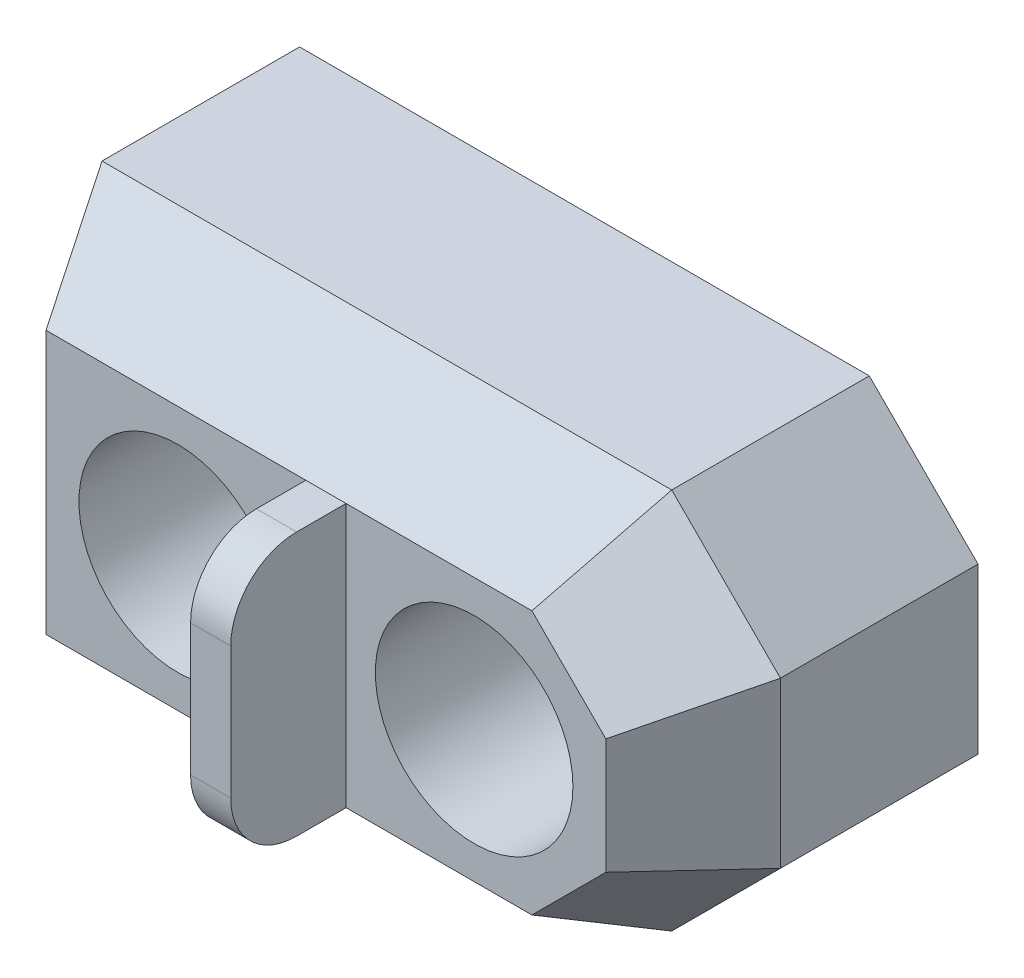
ISO-10303-21;
HEADER;
FILE_DESCRIPTION(('STEP AP214'),'2;1');
FILE_NAME('part.step','',(''),(''),'','','');
FILE_SCHEMA(('AUTOMOTIVE_DESIGN { 1 0 10303 214 1 1 1 1 }'));
ENDSEC;
DATA;
#1=APPLICATION_CONTEXT('core data for automotive mechanical design processes');
#2=APPLICATION_PROTOCOL_DEFINITION('international standard','automotive_design',2000,#1);
#3=PRODUCT_CONTEXT('',#1,'mechanical');
#4=PRODUCT('Part','Part','',(#3));
#5=PRODUCT_RELATED_PRODUCT_CATEGORY('part','',(#4));
#6=PRODUCT_DEFINITION_FORMATION('','',#4);
#7=PRODUCT_DEFINITION_CONTEXT('part definition',#1,'design');
#8=PRODUCT_DEFINITION('design','',#6,#7);
#9=PRODUCT_DEFINITION_SHAPE('','',#8);
#10=(LENGTH_UNIT() NAMED_UNIT(*) SI_UNIT(.MILLI.,.METRE.));
#11=(NAMED_UNIT(*) PLANE_ANGLE_UNIT() SI_UNIT($,.RADIAN.));
#12=(NAMED_UNIT(*) SI_UNIT($,.STERADIAN.) SOLID_ANGLE_UNIT());
#13=UNCERTAINTY_MEASURE_WITH_UNIT(LENGTH_MEASURE(1.E-05),#10,'distance_accuracy_value','');
#14=(GEOMETRIC_REPRESENTATION_CONTEXT(3) GLOBAL_UNCERTAINTY_ASSIGNED_CONTEXT((#13)) GLOBAL_UNIT_ASSIGNED_CONTEXT((#10,
#11,#12)) REPRESENTATION_CONTEXT('',''));
#15=CARTESIAN_POINT('',(0.,0.,0.));
#16=DIRECTION('',(0.,0.,1.));
#17=DIRECTION('',(1.,0.,0.));
#18=AXIS2_PLACEMENT_3D('',#15,#16,#17);
#19=CARTESIAN_POINT('',(-5.454819174,0.,0.));
#20=DIRECTION('',(-1.,0.,0.));
#21=DIRECTION('',(0.,0.,1.));
#22=AXIS2_PLACEMENT_3D('',#19,#20,#21);
#23=PLANE('',#22);
#24=CARTESIAN_POINT('',(-5.454819174,-1.9,5.5));
#25=DIRECTION('',(1.,0.,0.));
#26=DIRECTION('',(0.,0.,-1.));
#27=AXIS2_PLACEMENT_3D('',#24,#25,#26);
#28=CIRCLE('',#27,1.);
#29=CARTESIAN_POINT('',(-5.454819174,-1.9,6.5));
#30=VERTEX_POINT('',#29);
#31=CARTESIAN_POINT('',(-5.454819174,-0.9,5.5));
#32=VERTEX_POINT('',#31);
#33=EDGE_CURVE('E186',#30,#32,#28,.F.);
#34=ORIENTED_EDGE('',*,*,#33,.T.);
#35=DIRECTION('',(0.,0.,-1.));
#36=VECTOR('',#35,1.);
#37=CARTESIAN_POINT('',(-5.454819174,-0.9,0.));
#38=LINE('',#37,#36);
#39=CARTESIAN_POINT('',(-5.454819174,-0.899999999926634,4.75000000003773));
#40=VERTEX_POINT('',#39);
#41=EDGE_CURVE('E171',#32,#40,#38,.T.);
#42=ORIENTED_EDGE('',*,*,#41,.T.);
#43=DIRECTION('',(0.,1.,0.));
#44=VECTOR('',#43,1.);
#45=CARTESIAN_POINT('',(-5.454819174,0.,4.75));
#46=LINE('',#45,#44);
#47=CARTESIAN_POINT('',(-5.454819174,-4.89999999994664,4.74999999996913));
#48=VERTEX_POINT('',#47);
#49=EDGE_CURVE('E125',#40,#48,#46,.F.);
#50=ORIENTED_EDGE('',*,*,#49,.T.);
#51=DIRECTION('',(0.,0.,1.));
#52=VECTOR('',#51,1.);
#53=CARTESIAN_POINT('',(-5.454819174,-4.9,0.));
#54=LINE('',#53,#52);
#55=CARTESIAN_POINT('',(-5.454819174,-4.9,5.5));
#56=VERTEX_POINT('',#55);
#57=EDGE_CURVE('E121',#48,#56,#54,.T.);
#58=ORIENTED_EDGE('',*,*,#57,.T.);
#59=CARTESIAN_POINT('',(-5.454819174,-3.9,5.5));
#60=DIRECTION('',(1.,0.,0.));
#61=DIRECTION('',(0.,0.,-1.));
#62=AXIS2_PLACEMENT_3D('',#59,#60,#61);
#63=CIRCLE('',#62,1.);
#64=CARTESIAN_POINT('',(-5.454819174,-3.9,6.5));
#65=VERTEX_POINT('',#64);
#66=EDGE_CURVE('E19',#56,#65,#63,.F.);
#67=ORIENTED_EDGE('',*,*,#66,.T.);
#68=DIRECTION('',(0.,1.,0.));
#69=VECTOR('',#68,1.);
#70=CARTESIAN_POINT('',(-5.454819174,0.,6.5));
#71=LINE('',#70,#69);
#72=EDGE_CURVE('E187',#65,#30,#71,.T.);
#73=ORIENTED_EDGE('',*,*,#72,.T.);
#74=EDGE_LOOP('',(#34,#42,#50,#58,#67,#73));
#75=FACE_BOUND('',#74,.T.);
#76=ADVANCED_FACE('F16',(#75),#23,.T.);
#77=CARTESIAN_POINT('',(-5.454819174,-3.9,5.5));
#78=DIRECTION('',(1.,0.,0.));
#79=DIRECTION('',(0.,0.,-1.));
#80=AXIS2_PLACEMENT_3D('',#77,#78,#79);
#81=CYLINDRICAL_SURFACE('',#80,1.);
#82=DIRECTION('',(1.,0.,0.));
#83=VECTOR('',#82,1.);
#84=CARTESIAN_POINT('',(0.,-3.9,6.5));
#85=LINE('',#84,#83);
#86=CARTESIAN_POINT('',(-4.845,-3.9,6.5));
#87=VERTEX_POINT('',#86);
#88=EDGE_CURVE('E137',#87,#65,#85,.F.);
#89=ORIENTED_EDGE('',*,*,#88,.T.);
#90=ORIENTED_EDGE('',*,*,#66,.F.);
#91=DIRECTION('',(1.,0.,0.));
#92=VECTOR('',#91,1.);
#93=CARTESIAN_POINT('',(0.,-4.9,5.5));
#94=LINE('',#93,#92);
#95=CARTESIAN_POINT('',(-4.845,-4.9,5.5));
#96=VERTEX_POINT('',#95);
#97=EDGE_CURVE('E130',#56,#96,#94,.T.);
#98=ORIENTED_EDGE('',*,*,#97,.T.);
#99=CARTESIAN_POINT('',(-4.845,-3.9,5.5));
#100=DIRECTION('',(1.,0.,0.));
#101=DIRECTION('',(0.,0.,-1.));
#102=AXIS2_PLACEMENT_3D('',#99,#100,#101);
#103=CIRCLE('',#102,1.);
#104=EDGE_CURVE('E221',#96,#87,#103,.F.);
#105=ORIENTED_EDGE('',*,*,#104,.T.);
#106=EDGE_LOOP('',(#89,#90,#98,#105));
#107=FACE_BOUND('',#106,.T.);
#108=ADVANCED_FACE('F134',(#107),#81,.T.);
#109=CARTESIAN_POINT('',(0.,0.,6.5));
#110=DIRECTION('',(0.,0.,1.));
#111=DIRECTION('',(1.,0.,0.));
#112=AXIS2_PLACEMENT_3D('',#109,#110,#111);
#113=PLANE('',#112);
#114=DIRECTION('',(-1.,0.,0.));
#115=VECTOR('',#114,1.);
#116=CARTESIAN_POINT('',(-5.149909587,-1.9,6.5));
#117=LINE('',#116,#115);
#118=CARTESIAN_POINT('',(-4.845,-1.9,6.5));
#119=VERTEX_POINT('',#118);
#120=EDGE_CURVE('E183',#119,#30,#117,.T.);
#121=ORIENTED_EDGE('',*,*,#120,.T.);
#122=ORIENTED_EDGE('',*,*,#72,.F.);
#123=ORIENTED_EDGE('',*,*,#88,.F.);
#124=DIRECTION('',(0.,1.,0.));
#125=VECTOR('',#124,1.);
#126=CARTESIAN_POINT('',(-4.845,0.,6.5));
#127=LINE('',#126,#125);
#128=EDGE_CURVE('E220',#87,#119,#127,.T.);
#129=ORIENTED_EDGE('',*,*,#128,.T.);
#130=EDGE_LOOP('',(#121,#122,#123,#129));
#131=FACE_BOUND('',#130,.T.);
#132=ADVANCED_FACE('F421',(#131),#113,.T.);
#133=CARTESIAN_POINT('',(-5.454819174,-1.9,5.5));
#134=DIRECTION('',(1.,0.,0.));
#135=DIRECTION('',(0.,0.,-1.));
#136=AXIS2_PLACEMENT_3D('',#133,#134,#135);
#137=CYLINDRICAL_SURFACE('',#136,1.);
#138=ORIENTED_EDGE('',*,*,#120,.F.);
#139=CARTESIAN_POINT('',(-4.845,-1.9,5.5));
#140=DIRECTION('',(1.,0.,0.));
#141=DIRECTION('',(0.,0.,-1.));
#142=AXIS2_PLACEMENT_3D('',#139,#140,#141);
#143=CIRCLE('',#142,1.);
#144=CARTESIAN_POINT('',(-4.845,-0.9,5.5));
#145=VERTEX_POINT('',#144);
#146=EDGE_CURVE('E217',#119,#145,#143,.F.);
#147=ORIENTED_EDGE('',*,*,#146,.T.);
#148=DIRECTION('',(1.,0.,0.));
#149=VECTOR('',#148,1.);
#150=CARTESIAN_POINT('',(0.,-0.9,5.5));
#151=LINE('',#150,#149);
#152=EDGE_CURVE('E131',#145,#32,#151,.F.);
#153=ORIENTED_EDGE('',*,*,#152,.T.);
#154=ORIENTED_EDGE('',*,*,#33,.F.);
#155=EDGE_LOOP('',(#138,#147,#153,#154));
#156=FACE_BOUND('',#155,.T.);
#157=ADVANCED_FACE('F227',(#156),#137,.T.);
#158=CARTESIAN_POINT('',(0.,-0.9,0.));
#159=DIRECTION('',(0.,-1.,0.));
#160=DIRECTION('',(0.,0.,-1.));
#161=AXIS2_PLACEMENT_3D('',#158,#159,#160);
#162=PLANE('',#161);
#163=DIRECTION('',(0.,0.,-1.));
#164=VECTOR('',#163,1.);
#165=CARTESIAN_POINT('',(-4.845,-0.9,0.));
#166=LINE('',#165,#164);
#167=CARTESIAN_POINT('',(-4.845,-0.899999999987772,4.75));
#168=VERTEX_POINT('',#167);
#169=EDGE_CURVE('E219',#145,#168,#166,.T.);
#170=ORIENTED_EDGE('',*,*,#169,.T.);
#171=DIRECTION('',(1.,0.,0.));
#172=VECTOR('',#171,1.);
#173=CARTESIAN_POINT('',(0.,-0.899999999804357,4.75000000010062));
#174=LINE('',#173,#172);
#175=EDGE_CURVE('E172',#168,#40,#174,.F.);
#176=ORIENTED_EDGE('',*,*,#175,.T.);
#177=ORIENTED_EDGE('',*,*,#41,.F.);
#178=ORIENTED_EDGE('',*,*,#152,.F.);
#179=EDGE_LOOP('',(#170,#176,#177,#178));
#180=FACE_BOUND('',#179,.T.);
#181=ADVANCED_FACE('F231',(#180),#162,.F.);
#182=CARTESIAN_POINT('',(0.,-4.9,0.));
#183=DIRECTION('',(0.,1.,0.));
#184=DIRECTION('',(0.,0.,1.));
#185=AXIS2_PLACEMENT_3D('',#182,#183,#184);
#186=PLANE('',#185);
#187=ORIENTED_EDGE('',*,*,#57,.F.);
#188=DIRECTION('',(1.,0.,0.));
#189=VECTOR('',#188,1.);
#190=CARTESIAN_POINT('',(0.,-4.89999999989328,4.74999999994512));
#191=LINE('',#190,#189);
#192=CARTESIAN_POINT('',(-4.845,-4.9,4.75));
#193=VERTEX_POINT('',#192);
#194=EDGE_CURVE('E149',#48,#193,#191,.T.);
#195=ORIENTED_EDGE('',*,*,#194,.T.);
#196=DIRECTION('',(0.,0.,-1.));
#197=VECTOR('',#196,1.);
#198=CARTESIAN_POINT('',(-4.845,-4.9,0.));
#199=LINE('',#198,#197);
#200=EDGE_CURVE('E141',#193,#96,#199,.F.);
#201=ORIENTED_EDGE('',*,*,#200,.T.);
#202=ORIENTED_EDGE('',*,*,#97,.F.);
#203=EDGE_LOOP('',(#187,#195,#201,#202));
#204=FACE_BOUND('',#203,.T.);
#205=ADVANCED_FACE('F139',(#204),#186,.F.);
#206=CARTESIAN_POINT('',(-9.36571981798059,0.,4.81665590626966));
#207=DIRECTION('',(0.889287802322795,0.,-0.457348012611723));
#208=DIRECTION('',(-0.457348012611723,0.,-0.889287802322795));
#209=AXIS2_PLACEMENT_3D('',#206,#207,#208);
#210=PLANE('',#209);
#211=DIRECTION('',(-0.415914073839704,0.415914073831485,-0.808721810248097));
#212=VECTOR('',#211,1.);
#213=CARTESIAN_POINT('',(-9.4,-0.899999999804357,4.75000000010062));
#214=LINE('',#213,#212);
#215=CARTESIAN_POINT('',(-9.39999999967319,-0.899999999951089,4.74999999985708));
#216=VERTEX_POINT('',#215);
#217=CARTESIAN_POINT('',(-10.2999999993375,2.22321686342737E-11,2.99999999967071));
#218=VERTEX_POINT('',#217);
#219=EDGE_CURVE('E204',#216,#218,#214,.T.);
#220=ORIENTED_EDGE('',*,*,#219,.T.);
#221=DIRECTION('',(0.,1.,0.));
#222=VECTOR('',#221,1.);
#223=CARTESIAN_POINT('',(-10.3,0.,3.));
#224=LINE('',#223,#222);
#225=CARTESIAN_POINT('',(-10.2999999993375,-5.79999999998444,2.99999999965127));
#226=VERTEX_POINT('',#225);
#227=EDGE_CURVE('E306',#218,#226,#224,.F.);
#228=ORIENTED_EDGE('',*,*,#227,.T.);
#229=DIRECTION('',(0.415914073839705,0.415914073831485,0.808721810248097));
#230=VECTOR('',#229,1.);
#231=CARTESIAN_POINT('',(-10.3,-5.7999999998755,2.99999999993597));
#232=LINE('',#231,#230);
#233=CARTESIAN_POINT('',(-9.39999999934637,-4.89999999997332,4.74999999965013));
#234=VERTEX_POINT('',#233);
#235=EDGE_CURVE('E196',#226,#234,#232,.T.);
#236=ORIENTED_EDGE('',*,*,#235,.T.);
#237=DIRECTION('',(0.,1.,0.));
#238=VECTOR('',#237,1.);
#239=CARTESIAN_POINT('',(-9.4,0.,4.75));
#240=LINE('',#239,#238);
#241=EDGE_CURVE('E192',#234,#216,#240,.T.);
#242=ORIENTED_EDGE('',*,*,#241,.T.);
#243=EDGE_LOOP('',(#220,#228,#236,#242));
#244=FACE_BOUND('',#243,.T.);
#245=ADVANCED_FACE('F412',(#244),#210,.F.);
#246=CARTESIAN_POINT('',(2.5037487519156,-2.5037487519156,1.82100108436973));
#247=DIRECTION('',(-0.628821435442067,0.628821435442067,-0.457348012630596));
#248=DIRECTION('',(-0.707106781186547,-0.707106781186547,0.));
#249=AXIS2_PLACEMENT_3D('',#246,#247,#248);
#250=PLANE('',#249);
#251=DIRECTION('',(0.18612933749407,-0.449355971088496,-0.873747721582799));
#252=VECTOR('',#251,1.);
#253=CARTESIAN_POINT('',(-2.022792206,-4.89999999989328,4.74999999994512));
#254=LINE('',#253,#252);
#255=CARTESIAN_POINT('',(-2.02279220594251,-4.90000000003081,4.75000000002809));
#256=VERTEX_POINT('',#255);
#257=CARTESIAN_POINT('',(-1.64999999995264,-5.79999999998511,3.00000000000114));
#258=VERTEX_POINT('',#257);
#259=EDGE_CURVE('E151',#256,#258,#254,.T.);
#260=ORIENTED_EDGE('',*,*,#259,.T.);
#261=DIRECTION('',(0.707106781186548,0.707106781186548,0.));
#262=VECTOR('',#261,1.);
#263=CARTESIAN_POINT('',(2.07500000001414,-2.07500000001414,3.));
#264=LINE('',#263,#262);
#265=CARTESIAN_POINT('',(1.37411087677487E-10,-4.15000000009295,3.00000000008918));
#266=VERTEX_POINT('',#265);
#267=EDGE_CURVE('E298',#258,#266,#264,.T.);
#268=ORIENTED_EDGE('',*,*,#267,.T.);
#269=DIRECTION('',(-0.449355971088496,0.18612933749407,0.873747721582799));
#270=VECTOR('',#269,1.);
#271=CARTESIAN_POINT('',(1.77857294864081E-10,-4.15,3.00000000009147));
#272=LINE('',#271,#270);
#273=CARTESIAN_POINT('',(-0.899999999893598,-3.77720779405749,4.75000000006697));
#274=VERTEX_POINT('',#273);
#275=EDGE_CURVE('E250',#266,#274,#272,.T.);
#276=ORIENTED_EDGE('',*,*,#275,.T.);
#277=DIRECTION('',(-0.707106781186547,-0.707106781186547,0.));
#278=VECTOR('',#277,1.);
#279=CARTESIAN_POINT('',(1.43860389711498,-1.43860389711498,4.75000000008363));
#280=LINE('',#279,#278);
#281=EDGE_CURVE('E143',#256,#274,#280,.F.);
#282=ORIENTED_EDGE('',*,*,#281,.F.);
#283=EDGE_LOOP('',(#260,#268,#276,#282));
#284=FACE_BOUND('',#283,.T.);
#285=ADVANCED_FACE('F312',(#284),#250,.F.);
#286=CARTESIAN_POINT('',(0.210333645245286,0.210333645245286,0.152977728207776));
#287=DIRECTION('',(0.628821435442067,0.628821435442067,0.457348012630596));
#288=DIRECTION('',(-0.707106781186547,0.707106781186547,0.));
#289=AXIS2_PLACEMENT_3D('',#286,#287,#288);
#290=PLANE('',#289);
#291=DIRECTION('',(-0.707106781186547,0.707106781186547,0.));
#292=VECTOR('',#291,1.);
#293=CARTESIAN_POINT('',(-1.46139610306109,-1.46139610306109,4.74999999995557));
#294=LINE('',#293,#292);
#295=CARTESIAN_POINT('',(-0.899999999981633,-2.02279220603054,4.75000000000294));
#296=VERTEX_POINT('',#295);
#297=CARTESIAN_POINT('',(-2.02279220603054,-0.899999999981633,4.75000000000294));
#298=VERTEX_POINT('',#297);
#299=EDGE_CURVE('E145',#296,#298,#294,.T.);
#300=ORIENTED_EDGE('',*,*,#299,.F.);
#301=DIRECTION('',(0.449355971088496,0.18612933749407,-0.873747721582799));
#302=VECTOR('',#301,1.);
#303=CARTESIAN_POINT('',(-0.899999999804357,-2.022792206,4.75000000010062));
#304=LINE('',#303,#302);
#305=CARTESIAN_POINT('',(8.79468768369156E-11,-1.65000000000098,3.00000000004631));
#306=VERTEX_POINT('',#305);
#307=EDGE_CURVE('E248',#296,#306,#304,.T.);
#308=ORIENTED_EDGE('',*,*,#307,.T.);
#309=DIRECTION('',(0.707106781186548,-0.707106781186548,0.));
#310=VECTOR('',#309,1.);
#311=CARTESIAN_POINT('',(-0.825000000014142,-0.825000000014142,3.));
#312=LINE('',#311,#310);
#313=CARTESIAN_POINT('',(-1.65000000000039,2.18412209283211E-11,3.00000000001372));
#314=VERTEX_POINT('',#313);
#315=EDGE_CURVE('E272',#306,#314,#312,.F.);
#316=ORIENTED_EDGE('',*,*,#315,.T.);
#317=DIRECTION('',(-0.18612933749407,-0.449355971088496,0.873747721582799));
#318=VECTOR('',#317,1.);
#319=CARTESIAN_POINT('',(-1.65,1.77857294864081E-10,3.00000000009147));
#320=LINE('',#319,#318);
#321=EDGE_CURVE('E176',#314,#298,#320,.T.);
#322=ORIENTED_EDGE('',*,*,#321,.T.);
#323=EDGE_LOOP('',(#300,#308,#316,#322));
#324=FACE_BOUND('',#323,.T.);
#325=ADVANCED_FACE('F270',(#324),#290,.T.);
#326=CARTESIAN_POINT('',(0.,0.,4.75));
#327=DIRECTION('',(0.,0.,1.));
#328=DIRECTION('',(1.,0.,0.));
#329=AXIS2_PLACEMENT_3D('',#326,#327,#328);
#330=PLANE('',#329);
#331=CARTESIAN_POINT('',(-7.4,-2.9,4.75));
#332=DIRECTION('',(0.,0.,1.));
#333=DIRECTION('',(1.,0.,0.));
#334=AXIS2_PLACEMENT_3D('',#331,#332,#333);
#335=CIRCLE('',#334,1.5);
#336=CARTESIAN_POINT('',(-5.9,-2.9,4.75));
#337=VERTEX_POINT('',#336);
#338=EDGE_CURVE('E166',#337,#337,#335,.F.);
#339=ORIENTED_EDGE('',*,*,#338,.T.);
#340=EDGE_LOOP('',(#339));
#341=FACE_BOUND('',#340,.T.);
#342=ORIENTED_EDGE('',*,*,#241,.F.);
#343=DIRECTION('',(1.,0.,0.));
#344=VECTOR('',#343,1.);
#345=CARTESIAN_POINT('',(0.,-4.89999999989328,4.74999999994512));
#346=LINE('',#345,#344);
#347=EDGE_CURVE('E152',#234,#48,#346,.T.);
#348=ORIENTED_EDGE('',*,*,#347,.T.);
#349=ORIENTED_EDGE('',*,*,#49,.F.);
#350=DIRECTION('',(1.,0.,0.));
#351=VECTOR('',#350,1.);
#352=CARTESIAN_POINT('',(0.,-0.899999999804357,4.75000000010062));
#353=LINE('',#352,#351);
#354=EDGE_CURVE('E175',#40,#216,#353,.F.);
#355=ORIENTED_EDGE('',*,*,#354,.T.);
#356=EDGE_LOOP('',(#342,#348,#349,#355));
#357=FACE_BOUND('',#356,.T.);
#358=ADVANCED_FACE('F238',(#341,#357),#330,.T.);
#359=CARTESIAN_POINT('',(-4.845,0.,0.));
#360=DIRECTION('',(1.,0.,0.));
#361=DIRECTION('',(0.,0.,-1.));
#362=AXIS2_PLACEMENT_3D('',#359,#360,#361);
#363=PLANE('',#362);
#364=DIRECTION('',(0.,1.,0.));
#365=VECTOR('',#364,1.);
#366=CARTESIAN_POINT('',(-4.845,0.,4.75));
#367=LINE('',#366,#365);
#368=EDGE_CURVE('E162',#193,#168,#367,.T.);
#369=ORIENTED_EDGE('',*,*,#368,.T.);
#370=ORIENTED_EDGE('',*,*,#169,.F.);
#371=ORIENTED_EDGE('',*,*,#146,.F.);
#372=ORIENTED_EDGE('',*,*,#128,.F.);
#373=ORIENTED_EDGE('',*,*,#104,.F.);
#374=ORIENTED_EDGE('',*,*,#200,.F.);
#375=EDGE_LOOP('',(#369,#370,#371,#372,#373,#374));
#376=FACE_BOUND('',#375,.T.);
#377=ADVANCED_FACE('F401',(#376),#363,.T.);
#378=CARTESIAN_POINT('',(0.,1.22014202727439,0.627501614011148));
#379=DIRECTION('',(0.,0.889287802322795,0.457348012611723));
#380=DIRECTION('',(0.,-0.457348012611723,0.889287802322795));
#381=AXIS2_PLACEMENT_3D('',#378,#379,#380);
#382=PLANE('',#381);
#383=ORIENTED_EDGE('',*,*,#354,.F.);
#384=ORIENTED_EDGE('',*,*,#175,.F.);
#385=DIRECTION('',(1.,0.,0.));
#386=VECTOR('',#385,1.);
#387=CARTESIAN_POINT('',(0.,-0.9,4.75));
#388=LINE('',#387,#386);
#389=EDGE_CURVE('E165',#168,#298,#388,.T.);
#390=ORIENTED_EDGE('',*,*,#389,.T.);
#391=ORIENTED_EDGE('',*,*,#321,.F.);
#392=DIRECTION('',(1.,0.,0.));
#393=VECTOR('',#392,1.);
#394=CARTESIAN_POINT('',(0.,0.,3.));
#395=LINE('',#394,#393);
#396=EDGE_CURVE('E216',#314,#218,#395,.F.);
#397=ORIENTED_EDGE('',*,*,#396,.T.);
#398=ORIENTED_EDGE('',*,*,#219,.F.);
#399=EDGE_LOOP('',(#383,#384,#390,#391,#397,#398));
#400=FACE_BOUND('',#399,.T.);
#401=ADVANCED_FACE('F241',(#400),#382,.T.);
#402=CARTESIAN_POINT('',(1.22014202727439,0.,0.627501614011148));
#403=DIRECTION('',(-0.889287802322795,0.,-0.457348012611723));
#404=DIRECTION('',(-0.457348012611723,0.,0.889287802322795));
#405=AXIS2_PLACEMENT_3D('',#402,#403,#404);
#406=PLANE('',#405);
#407=ORIENTED_EDGE('',*,*,#275,.F.);
#408=DIRECTION('',(0.,1.,0.));
#409=VECTOR('',#408,1.);
#410=CARTESIAN_POINT('',(0.,0.,3.));
#411=LINE('',#410,#409);
#412=EDGE_CURVE('E292',#266,#306,#411,.T.);
#413=ORIENTED_EDGE('',*,*,#412,.T.);
#414=ORIENTED_EDGE('',*,*,#307,.F.);
#415=DIRECTION('',(0.,1.,0.));
#416=VECTOR('',#415,1.);
#417=CARTESIAN_POINT('',(-0.9,0.,4.75));
#418=LINE('',#417,#416);
#419=EDGE_CURVE('E159',#296,#274,#418,.F.);
#420=ORIENTED_EDGE('',*,*,#419,.T.);
#421=EDGE_LOOP('',(#407,#413,#414,#420));
#422=FACE_BOUND('',#421,.T.);
#423=ADVANCED_FACE('F316',(#422),#406,.F.);
#424=CARTESIAN_POINT('',(0.,-5.80697224006065,2.98644286624228));
#425=DIRECTION('',(0.,-0.889287802322795,0.457348012611723));
#426=DIRECTION('',(0.,-0.457348012611723,-0.889287802322795));
#427=AXIS2_PLACEMENT_3D('',#424,#425,#426);
#428=PLANE('',#427);
#429=DIRECTION('',(1.,0.,0.));
#430=VECTOR('',#429,1.);
#431=CARTESIAN_POINT('',(0.,-4.9,4.75));
#432=LINE('',#431,#430);
#433=EDGE_CURVE('E155',#256,#193,#432,.F.);
#434=ORIENTED_EDGE('',*,*,#433,.T.);
#435=ORIENTED_EDGE('',*,*,#194,.F.);
#436=ORIENTED_EDGE('',*,*,#347,.F.);
#437=ORIENTED_EDGE('',*,*,#235,.F.);
#438=DIRECTION('',(1.,0.,0.));
#439=VECTOR('',#438,1.);
#440=CARTESIAN_POINT('',(0.,-5.8,3.));
#441=LINE('',#440,#439);
#442=EDGE_CURVE('E300',#226,#258,#441,.T.);
#443=ORIENTED_EDGE('',*,*,#442,.T.);
#444=ORIENTED_EDGE('',*,*,#259,.F.);
#445=EDGE_LOOP('',(#434,#435,#436,#437,#443,#444));
#446=FACE_BOUND('',#445,.T.);
#447=ADVANCED_FACE('F393',(#446),#428,.T.);
#448=CARTESIAN_POINT('',(-10.3,0.,0.));
#449=DIRECTION('',(-1.,0.,0.));
#450=DIRECTION('',(0.,0.,1.));
#451=AXIS2_PLACEMENT_3D('',#448,#449,#450);
#452=PLANE('',#451);
#453=DIRECTION('',(0.,1.,0.));
#454=VECTOR('',#453,1.);
#455=CARTESIAN_POINT('',(-10.3,0.,0.));
#456=LINE('',#455,#454);
#457=CARTESIAN_POINT('',(-10.3,0.,0.));
#458=VERTEX_POINT('',#457);
#459=CARTESIAN_POINT('',(-10.3,-5.8,0.));
#460=VERTEX_POINT('',#459);
#461=EDGE_CURVE('E158',#458,#460,#456,.F.);
#462=ORIENTED_EDGE('',*,*,#461,.T.);
#463=DIRECTION('',(0.,0.,1.));
#464=VECTOR('',#463,1.);
#465=CARTESIAN_POINT('',(-10.3,-5.8,0.));
#466=LINE('',#465,#464);
#467=EDGE_CURVE('E303',#460,#226,#466,.T.);
#468=ORIENTED_EDGE('',*,*,#467,.T.);
#469=ORIENTED_EDGE('',*,*,#227,.F.);
#470=DIRECTION('',(0.,0.,-1.));
#471=VECTOR('',#470,1.);
#472=CARTESIAN_POINT('',(-10.3,0.,0.));
#473=LINE('',#472,#471);
#474=EDGE_CURVE('E278',#218,#458,#473,.T.);
#475=ORIENTED_EDGE('',*,*,#474,.T.);
#476=EDGE_LOOP('',(#462,#468,#469,#475));
#477=FACE_BOUND('',#476,.T.);
#478=ADVANCED_FACE('F375',(#477),#452,.T.);
#479=CARTESIAN_POINT('',(0.,-5.8,0.));
#480=DIRECTION('',(0.,1.,0.));
#481=DIRECTION('',(0.,0.,1.));
#482=AXIS2_PLACEMENT_3D('',#479,#480,#481);
#483=PLANE('',#482);
#484=ORIENTED_EDGE('',*,*,#467,.F.);
#485=DIRECTION('',(1.,0.,0.));
#486=VECTOR('',#485,1.);
#487=CARTESIAN_POINT('',(0.,-5.8,0.));
#488=LINE('',#487,#486);
#489=CARTESIAN_POINT('',(-1.64999999999646,-5.80000000000353,0.));
#490=VERTEX_POINT('',#489);
#491=EDGE_CURVE('E372',#460,#490,#488,.T.);
#492=ORIENTED_EDGE('',*,*,#491,.T.);
#493=DIRECTION('',(0.,0.,1.));
#494=VECTOR('',#493,1.);
#495=CARTESIAN_POINT('',(-1.64999999998586,-5.80000000001414,0.));
#496=LINE('',#495,#494);
#497=EDGE_CURVE('E295',#490,#258,#496,.T.);
#498=ORIENTED_EDGE('',*,*,#497,.T.);
#499=ORIENTED_EDGE('',*,*,#442,.F.);
#500=EDGE_LOOP('',(#484,#492,#498,#499));
#501=FACE_BOUND('',#500,.T.);
#502=ADVANCED_FACE('F380',(#501),#483,.F.);
#503=CARTESIAN_POINT('',(2.07500000001414,-2.07500000001414,0.));
#504=DIRECTION('',(0.707106781186548,-0.707106781186548,0.));
#505=DIRECTION('',(0.707106781186548,0.707106781186548,0.));
#506=AXIS2_PLACEMENT_3D('',#503,#504,#505);
#507=PLANE('',#506);
#508=DIRECTION('',(0.707106781186547,0.707106781186548,0.));
#509=VECTOR('',#508,1.);
#510=CARTESIAN_POINT('',(-1.65,-5.8,0.));
#511=LINE('',#510,#509);
#512=CARTESIAN_POINT('',(7.07135630433064E-12,-4.15000000000707,0.));
#513=VERTEX_POINT('',#512);
#514=EDGE_CURVE('E368',#490,#513,#511,.T.);
#515=ORIENTED_EDGE('',*,*,#514,.T.);
#516=DIRECTION('',(0.,0.,-1.));
#517=VECTOR('',#516,1.);
#518=CARTESIAN_POINT('',(0.,-4.15,0.));
#519=LINE('',#518,#517);
#520=EDGE_CURVE('E289',#513,#266,#519,.F.);
#521=ORIENTED_EDGE('',*,*,#520,.T.);
#522=ORIENTED_EDGE('',*,*,#267,.F.);
#523=ORIENTED_EDGE('',*,*,#497,.F.);
#524=EDGE_LOOP('',(#515,#521,#522,#523));
#525=FACE_BOUND('',#524,.T.);
#526=ADVANCED_FACE('F334',(#525),#507,.T.);
#527=CARTESIAN_POINT('',(0.,0.,0.));
#528=DIRECTION('',(1.,0.,0.));
#529=DIRECTION('',(0.,0.,-1.));
#530=AXIS2_PLACEMENT_3D('',#527,#528,#529);
#531=PLANE('',#530);
#532=DIRECTION('',(0.,1.,0.));
#533=VECTOR('',#532,1.);
#534=CARTESIAN_POINT('',(0.,0.,0.));
#535=LINE('',#534,#533);
#536=CARTESIAN_POINT('',(-3.53554262689376E-12,-1.65000000000354,0.));
#537=VERTEX_POINT('',#536);
#538=EDGE_CURVE('E322',#513,#537,#535,.T.);
#539=ORIENTED_EDGE('',*,*,#538,.T.);
#540=DIRECTION('',(0.,0.,1.));
#541=VECTOR('',#540,1.);
#542=CARTESIAN_POINT('',(-1.41418994570319E-11,-1.65000000001414,0.));
#543=LINE('',#542,#541);
#544=EDGE_CURVE('E286',#537,#306,#543,.T.);
#545=ORIENTED_EDGE('',*,*,#544,.T.);
#546=ORIENTED_EDGE('',*,*,#412,.F.);
#547=ORIENTED_EDGE('',*,*,#520,.F.);
#548=EDGE_LOOP('',(#539,#545,#546,#547));
#549=FACE_BOUND('',#548,.T.);
#550=ADVANCED_FACE('F320',(#549),#531,.T.);
#551=CARTESIAN_POINT('',(-0.825000000014142,-0.825000000014142,0.));
#552=DIRECTION('',(-0.707106781186548,-0.707106781186548,0.));
#553=DIRECTION('',(0.707106781186548,-0.707106781186548,0.));
#554=AXIS2_PLACEMENT_3D('',#551,#552,#553);
#555=PLANE('',#554);
#556=ORIENTED_EDGE('',*,*,#544,.F.);
#557=DIRECTION('',(-0.707106781186548,0.707106781186548,0.));
#558=VECTOR('',#557,1.);
#559=CARTESIAN_POINT('',(0.,-1.65,0.));
#560=LINE('',#559,#558);
#561=CARTESIAN_POINT('',(-1.65000000000707,-7.07094972851596E-12,0.));
#562=VERTEX_POINT('',#561);
#563=EDGE_CURVE('E34',#537,#562,#560,.T.);
#564=ORIENTED_EDGE('',*,*,#563,.T.);
#565=DIRECTION('',(0.,0.,-1.));
#566=VECTOR('',#565,1.);
#567=CARTESIAN_POINT('',(-1.65,0.,0.));
#568=LINE('',#567,#566);
#569=EDGE_CURVE('E276',#562,#314,#568,.F.);
#570=ORIENTED_EDGE('',*,*,#569,.T.);
#571=ORIENTED_EDGE('',*,*,#315,.F.);
#572=EDGE_LOOP('',(#556,#564,#570,#571));
#573=FACE_BOUND('',#572,.T.);
#574=ADVANCED_FACE('F323',(#573),#555,.F.);
#575=CARTESIAN_POINT('',(0.,0.,0.));
#576=DIRECTION('',(0.,-1.,0.));
#577=DIRECTION('',(0.,0.,-1.));
#578=AXIS2_PLACEMENT_3D('',#575,#576,#577);
#579=PLANE('',#578);
#580=ORIENTED_EDGE('',*,*,#569,.F.);
#581=DIRECTION('',(1.,0.,0.));
#582=VECTOR('',#581,1.);
#583=CARTESIAN_POINT('',(0.,0.,0.));
#584=LINE('',#583,#582);
#585=EDGE_CURVE('E213',#562,#458,#584,.F.);
#586=ORIENTED_EDGE('',*,*,#585,.T.);
#587=ORIENTED_EDGE('',*,*,#474,.F.);
#588=ORIENTED_EDGE('',*,*,#396,.F.);
#589=EDGE_LOOP('',(#580,#586,#587,#588));
#590=FACE_BOUND('',#589,.T.);
#591=ADVANCED_FACE('F274',(#590),#579,.F.);
#592=CARTESIAN_POINT('',(-7.4,-2.9,0.));
#593=DIRECTION('',(0.,0.,1.));
#594=DIRECTION('',(1.,0.,0.));
#595=AXIS2_PLACEMENT_3D('',#592,#593,#594);
#596=CYLINDRICAL_SURFACE('',#595,1.5);
#597=ORIENTED_EDGE('',*,*,#338,.F.);
#598=EDGE_LOOP('',(#597));
#599=FACE_BOUND('',#598,.T.);
#600=CARTESIAN_POINT('',(-7.4,-2.9,0.));
#601=DIRECTION('',(0.,0.,1.));
#602=DIRECTION('',(1.,0.,0.));
#603=AXIS2_PLACEMENT_3D('',#600,#601,#602);
#604=CIRCLE('',#603,1.5);
#605=CARTESIAN_POINT('',(-5.9,-2.9,0.));
#606=VERTEX_POINT('',#605);
#607=EDGE_CURVE('E210',#606,#606,#604,.F.);
#608=ORIENTED_EDGE('',*,*,#607,.T.);
#609=EDGE_LOOP('',(#608));
#610=FACE_BOUND('',#609,.T.);
#611=ADVANCED_FACE('F332',(#599,#610),#596,.F.);
#612=CARTESIAN_POINT('',(0.,0.,4.75));
#613=DIRECTION('',(0.,0.,1.));
#614=DIRECTION('',(1.,0.,0.));
#615=AXIS2_PLACEMENT_3D('',#612,#613,#614);
#616=PLANE('',#615);
#617=CARTESIAN_POINT('',(-2.9,-2.9,4.75));
#618=DIRECTION('',(0.,0.,1.));
#619=DIRECTION('',(1.,0.,0.));
#620=AXIS2_PLACEMENT_3D('',#617,#618,#619);
#621=CIRCLE('',#620,1.5);
#622=CARTESIAN_POINT('',(-1.4,-2.9,4.75));
#623=VERTEX_POINT('',#622);
#624=EDGE_CURVE('E25',#623,#623,#621,.F.);
#625=ORIENTED_EDGE('',*,*,#624,.T.);
#626=EDGE_LOOP('',(#625));
#627=FACE_BOUND('',#626,.T.);
#628=ORIENTED_EDGE('',*,*,#281,.T.);
#629=ORIENTED_EDGE('',*,*,#419,.F.);
#630=ORIENTED_EDGE('',*,*,#299,.T.);
#631=ORIENTED_EDGE('',*,*,#389,.F.);
#632=ORIENTED_EDGE('',*,*,#368,.F.);
#633=ORIENTED_EDGE('',*,*,#433,.F.);
#634=EDGE_LOOP('',(#628,#629,#630,#631,#632,#633));
#635=FACE_BOUND('',#634,.T.);
#636=ADVANCED_FACE('F265',(#627,#635),#616,.T.);
#637=CARTESIAN_POINT('',(0.,0.,0.));
#638=DIRECTION('',(0.,0.,1.));
#639=DIRECTION('',(1.,0.,0.));
#640=AXIS2_PLACEMENT_3D('',#637,#638,#639);
#641=PLANE('',#640);
#642=ORIENTED_EDGE('',*,*,#607,.F.);
#643=EDGE_LOOP('',(#642));
#644=FACE_BOUND('',#643,.T.);
#645=CARTESIAN_POINT('',(-2.9,-2.9,0.));
#646=DIRECTION('',(0.,0.,1.));
#647=DIRECTION('',(1.,0.,0.));
#648=AXIS2_PLACEMENT_3D('',#645,#646,#647);
#649=CIRCLE('',#648,1.5);
#650=CARTESIAN_POINT('',(-1.4,-2.9,0.));
#651=VERTEX_POINT('',#650);
#652=EDGE_CURVE('E10',#651,#651,#649,.T.);
#653=ORIENTED_EDGE('',*,*,#652,.T.);
#654=EDGE_LOOP('',(#653));
#655=FACE_BOUND('',#654,.T.);
#656=ORIENTED_EDGE('',*,*,#563,.F.);
#657=ORIENTED_EDGE('',*,*,#538,.F.);
#658=ORIENTED_EDGE('',*,*,#514,.F.);
#659=ORIENTED_EDGE('',*,*,#491,.F.);
#660=ORIENTED_EDGE('',*,*,#461,.F.);
#661=ORIENTED_EDGE('',*,*,#585,.F.);
#662=EDGE_LOOP('',(#656,#657,#658,#659,#660,#661));
#663=FACE_BOUND('',#662,.T.);
#664=ADVANCED_FACE('F338',(#644,#655,#663),#641,.F.);
#665=CARTESIAN_POINT('',(-2.9,-2.9,0.));
#666=DIRECTION('',(0.,0.,1.));
#667=DIRECTION('',(1.,0.,0.));
#668=AXIS2_PLACEMENT_3D('',#665,#666,#667);
#669=CYLINDRICAL_SURFACE('',#668,1.5);
#670=ORIENTED_EDGE('',*,*,#624,.F.);
#671=EDGE_LOOP('',(#670));
#672=FACE_BOUND('',#671,.T.);
#673=ORIENTED_EDGE('',*,*,#652,.F.);
#674=EDGE_LOOP('',(#673));
#675=FACE_BOUND('',#674,.T.);
#676=ADVANCED_FACE('F336',(#672,#675),#669,.F.);
#677=CLOSED_SHELL('',(#76,#108,#132,#157,#181,#205,#245,#285,#325,#358,#377,#401,#423,#447,#478,
#502,#526,#550,#574,#591,#611,#636,#664,#676));
#678=MANIFOLD_SOLID_BREP('B1',#677);
#679=ADVANCED_BREP_SHAPE_REPRESENTATION('',(#18,#678),#14);
#680=SHAPE_DEFINITION_REPRESENTATION(#9,#679);
ENDSEC;
END-ISO-10303-21;
